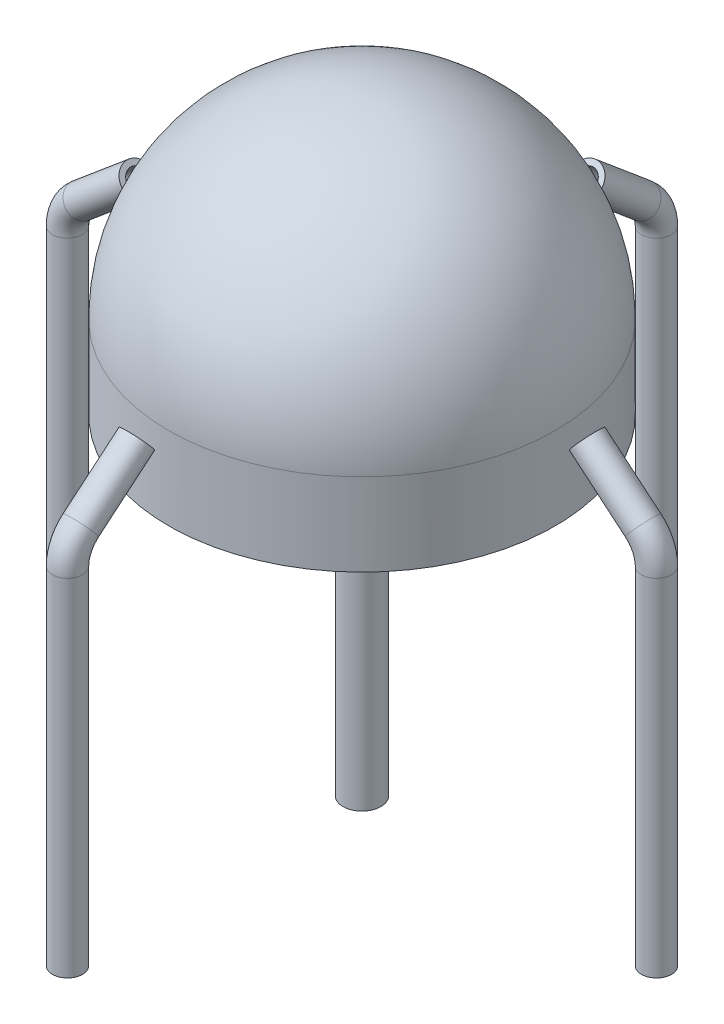
ISO-10303-21;
HEADER;
FILE_DESCRIPTION(('STEP AP214'),'2;1');
FILE_NAME('part.step','',(''),(''),'','','');
FILE_SCHEMA(('AUTOMOTIVE_DESIGN { 1 0 10303 214 1 1 1 1 }'));
ENDSEC;
DATA;
#1=APPLICATION_CONTEXT('core data for automotive mechanical design processes');
#2=APPLICATION_PROTOCOL_DEFINITION('international standard','automotive_design',2000,#1);
#3=PRODUCT_CONTEXT('',#1,'mechanical');
#4=PRODUCT('Part','Part','',(#3));
#5=PRODUCT_RELATED_PRODUCT_CATEGORY('part','',(#4));
#6=PRODUCT_DEFINITION_FORMATION('','',#4);
#7=PRODUCT_DEFINITION_CONTEXT('part definition',#1,'design');
#8=PRODUCT_DEFINITION('design','',#6,#7);
#9=PRODUCT_DEFINITION_SHAPE('','',#8);
#10=(LENGTH_UNIT() NAMED_UNIT(*) SI_UNIT(.MILLI.,.METRE.));
#11=(NAMED_UNIT(*) PLANE_ANGLE_UNIT() SI_UNIT($,.RADIAN.));
#12=(NAMED_UNIT(*) SI_UNIT($,.STERADIAN.) SOLID_ANGLE_UNIT());
#13=UNCERTAINTY_MEASURE_WITH_UNIT(LENGTH_MEASURE(1.E-05),#10,'distance_accuracy_value','');
#14=(GEOMETRIC_REPRESENTATION_CONTEXT(3) GLOBAL_UNCERTAINTY_ASSIGNED_CONTEXT((#13)) GLOBAL_UNIT_ASSIGNED_CONTEXT((#10,
#11,#12)) REPRESENTATION_CONTEXT('',''));
#15=CARTESIAN_POINT('',(0.,0.,0.));
#16=DIRECTION('',(0.,0.,1.));
#17=DIRECTION('',(1.,0.,0.));
#18=AXIS2_PLACEMENT_3D('',#15,#16,#17);
#19=CARTESIAN_POINT('',(0.,0.,0.));
#20=DIRECTION('',(0.,1.,0.));
#21=DIRECTION('',(0.,0.,1.));
#22=AXIS2_PLACEMENT_3D('',#19,#20,#21);
#23=PLANE('',#22);
#24=CARTESIAN_POINT('',(0.,0.,0.));
#25=DIRECTION('',(0.,1.,0.));
#26=DIRECTION('',(0.,0.,1.));
#27=AXIS2_PLACEMENT_3D('',#24,#25,#26);
#28=CIRCLE('',#27,3.54);
#29=CARTESIAN_POINT('',(0.,0.,3.54));
#30=VERTEX_POINT('',#29);
#31=EDGE_CURVE('E57',#30,#30,#28,.T.);
#32=ORIENTED_EDGE('',*,*,#31,.F.);
#33=EDGE_LOOP('',(#32));
#34=FACE_BOUND('',#33,.T.);
#35=CARTESIAN_POINT('',(0.,0.,0.));
#36=DIRECTION('',(0.,1.,0.));
#37=DIRECTION('',(0.,0.,1.));
#38=AXIS2_PLACEMENT_3D('',#35,#36,#37);
#39=CIRCLE('',#38,5.04);
#40=CARTESIAN_POINT('',(0.,0.,5.04));
#41=VERTEX_POINT('',#40);
#42=EDGE_CURVE('E46',#41,#41,#39,.T.);
#43=ORIENTED_EDGE('',*,*,#42,.T.);
#44=EDGE_LOOP('',(#43));
#45=FACE_BOUND('',#44,.T.);
#46=ADVANCED_FACE('F42',(#34,#45),#23,.T.);
#47=CARTESIAN_POINT('',(0.,-110.,0.));
#48=DIRECTION('',(0.,1.,0.));
#49=DIRECTION('',(0.,0.,1.));
#50=AXIS2_PLACEMENT_3D('',#47,#48,#49);
#51=PLANE('',#50);
#52=CARTESIAN_POINT('',(0.,-110.,0.));
#53=DIRECTION('',(0.,1.,0.));
#54=DIRECTION('',(0.,0.,1.));
#55=AXIS2_PLACEMENT_3D('',#52,#53,#54);
#56=CIRCLE('',#55,3.54);
#57=CARTESIAN_POINT('',(0.,-110.,3.54));
#58=VERTEX_POINT('',#57);
#59=EDGE_CURVE('E53',#58,#58,#56,.T.);
#60=ORIENTED_EDGE('',*,*,#59,.T.);
#61=EDGE_LOOP('',(#60));
#62=FACE_BOUND('',#61,.T.);
#63=CARTESIAN_POINT('',(0.,-110.,0.));
#64=DIRECTION('',(0.,1.,0.));
#65=DIRECTION('',(0.,0.,1.));
#66=AXIS2_PLACEMENT_3D('',#63,#64,#65);
#67=CIRCLE('',#66,5.04);
#68=CARTESIAN_POINT('',(0.,-110.,5.04));
#69=VERTEX_POINT('',#68);
#70=EDGE_CURVE('E11',#69,#69,#67,.T.);
#71=ORIENTED_EDGE('',*,*,#70,.F.);
#72=EDGE_LOOP('',(#71));
#73=FACE_BOUND('',#72,.T.);
#74=ADVANCED_FACE('F65',(#62,#73),#51,.F.);
#75=CARTESIAN_POINT('',(0.,0.,0.));
#76=DIRECTION('',(0.,-1.,0.));
#77=DIRECTION('',(0.,0.,-1.));
#78=AXIS2_PLACEMENT_3D('',#75,#76,#77);
#79=CYLINDRICAL_SURFACE('',#78,5.04);
#80=ORIENTED_EDGE('',*,*,#70,.T.);
#81=EDGE_LOOP('',(#80));
#82=FACE_BOUND('',#81,.T.);
#83=ORIENTED_EDGE('',*,*,#42,.F.);
#84=EDGE_LOOP('',(#83));
#85=FACE_BOUND('',#84,.T.);
#86=ADVANCED_FACE('F44',(#82,#85),#79,.T.);
#87=CARTESIAN_POINT('',(0.,0.,0.));
#88=DIRECTION('',(0.,-1.,0.));
#89=DIRECTION('',(0.,0.,-1.));
#90=AXIS2_PLACEMENT_3D('',#87,#88,#89);
#91=CYLINDRICAL_SURFACE('',#90,3.54);
#92=ORIENTED_EDGE('',*,*,#59,.F.);
#93=EDGE_LOOP('',(#92));
#94=FACE_BOUND('',#93,.T.);
#95=ORIENTED_EDGE('',*,*,#31,.T.);
#96=EDGE_LOOP('',(#95));
#97=FACE_BOUND('',#96,.T.);
#98=ADVANCED_FACE('F61',(#94,#97),#91,.F.);
#99=CLOSED_SHELL('',(#46,#74,#86,#98));
#100=MANIFOLD_SOLID_BREP('B2',#99);
#101=CARTESIAN_POINT('',(0.,-110.,-78.4800007493152));
#102=DIRECTION('',(0.,1.,0.));
#103=DIRECTION('',(0.,0.,1.));
#104=AXIS2_PLACEMENT_3D('',#101,#102,#103);
#105=PLANE('',#104);
#106=CARTESIAN_POINT('',(0.,-110.,-78.4800007493152));
#107=DIRECTION('',(0.,1.,0.));
#108=DIRECTION('',(0.,0.,1.));
#109=AXIS2_PLACEMENT_3D('',#106,#107,#108);
#110=CIRCLE('',#109,2.5);
#111=CARTESIAN_POINT('',(0.,-110.,-75.9800007493152));
#112=VERTEX_POINT('',#111);
#113=EDGE_CURVE('E141',#112,#112,#110,.T.);
#114=ORIENTED_EDGE('',*,*,#113,.T.);
#115=EDGE_LOOP('',(#114));
#116=FACE_BOUND('',#115,.T.);
#117=CARTESIAN_POINT('',(0.,-110.,-78.4800007493152));
#118=DIRECTION('',(0.,1.,0.));
#119=DIRECTION('',(0.,0.,1.));
#120=AXIS2_PLACEMENT_3D('',#117,#118,#119);
#121=CIRCLE('',#120,4.);
#122=CARTESIAN_POINT('',(0.,-110.,-74.4800007493152));
#123=VERTEX_POINT('',#122);
#124=EDGE_CURVE('E124',#123,#123,#121,.T.);
#125=ORIENTED_EDGE('',*,*,#124,.F.);
#126=EDGE_LOOP('',(#125));
#127=FACE_BOUND('',#126,.T.);
#128=ADVANCED_FACE('F112',(#116,#127),#105,.F.);
#129=CARTESIAN_POINT('',(0.,2.39999999999995,-60.));
#130=DIRECTION('',(0.,0.642758197121759,0.76606912222905));
#131=DIRECTION('',(0.,-0.76606912222905,0.642758197121759));
#132=AXIS2_PLACEMENT_3D('',#129,#130,#131);
#133=PLANE('',#132);
#134=CARTESIAN_POINT('',(0.,2.39999999999995,-60.));
#135=DIRECTION('',(0.,0.642758197121759,0.76606912222905));
#136=DIRECTION('',(0.,-0.76606912222905,0.642758197121759));
#137=AXIS2_PLACEMENT_3D('',#134,#135,#136);
#138=CIRCLE('',#137,2.5);
#139=CARTESIAN_POINT('',(0.,0.484827194427324,-58.3931045071956));
#140=VERTEX_POINT('',#139);
#141=EDGE_CURVE('E136',#140,#140,#138,.T.);
#142=ORIENTED_EDGE('',*,*,#141,.F.);
#143=EDGE_LOOP('',(#142));
#144=FACE_BOUND('',#143,.T.);
#145=CARTESIAN_POINT('',(0.,2.39999999999995,-60.));
#146=DIRECTION('',(0.,0.642758197121759,0.76606912222905));
#147=DIRECTION('',(0.,-0.76606912222905,0.642758197121759));
#148=AXIS2_PLACEMENT_3D('',#145,#146,#147);
#149=CIRCLE('',#148,4.);
#150=CARTESIAN_POINT('',(0.,-0.66427648891625,-57.428967211513));
#151=VERTEX_POINT('',#150);
#152=EDGE_CURVE('E116',#151,#151,#149,.T.);
#153=ORIENTED_EDGE('',*,*,#152,.T.);
#154=EDGE_LOOP('',(#153));
#155=FACE_BOUND('',#154,.T.);
#156=ADVANCED_FACE('F174',(#144,#155),#133,.T.);
#157=CARTESIAN_POINT('',(0.,-17.7661298370008,-68.4854328987603));
#158=DIRECTION('',(-1.,0.,0.));
#159=DIRECTION('',(0.,0.,1.));
#160=AXIS2_PLACEMENT_3D('',#157,#158,#159);
#161=TOROIDAL_SURFACE('',#160,9.9945678505549,4.);
#162=CARTESIAN_POINT('',(0.,-10.1096000315074,-74.9095232989428));
#163=DIRECTION('',(0.,-0.642758197121758,-0.76606912222905));
#164=DIRECTION('',(0.,0.76606912222905,-0.642758197121758));
#165=AXIS2_PLACEMENT_3D('',#162,#163,#164);
#166=CIRCLE('',#165,4.);
#167=CARTESIAN_POINT('',(0.,-7.04532352775131,-77.4805560998811));
#168=VERTEX_POINT('',#167);
#169=EDGE_CURVE('E41',#168,#168,#166,.F.);
#170=CARTESIAN_POINT('',(0.,-17.7661298370008,-78.4800007493152));
#171=DIRECTION('',(0.,1.,0.));
#172=DIRECTION('',(0.,0.,1.));
#173=AXIS2_PLACEMENT_3D('',#170,#171,#172);
#174=CIRCLE('',#173,4.);
#175=CARTESIAN_POINT('',(0.,-17.7661298370008,-82.4800007493152));
#176=VERTEX_POINT('',#175);
#177=EDGE_CURVE('E126',#176,#176,#174,.T.);
#178=CARTESIAN_POINT('',(0.,-17.7661298370008,-68.4854328987603));
#179=DIRECTION('',(-1.,0.,0.));
#180=DIRECTION('',(0.,0.,1.));
#181=AXIS2_PLACEMENT_3D('',#178,#179,#180);
#182=CIRCLE('',#181,13.9945678505549);
#183=EDGE_CURVE('',#168,#176,#182,.T.);
#184=ORIENTED_EDGE('',*,*,#169,.F.);
#185=ORIENTED_EDGE('',*,*,#177,.T.);
#186=ORIENTED_EDGE('',*,*,#183,.T.);
#187=ORIENTED_EDGE('',*,*,#183,.F.);
#188=EDGE_LOOP('',(#184,#186,#185,#187));
#189=FACE_BOUND('',#188,.T.);
#190=ADVANCED_FACE('F177',(#189),#161,.T.);
#191=CARTESIAN_POINT('',(0.,-17.7661298370008,-78.4800007493152));
#192=DIRECTION('',(0.,-1.,0.));
#193=DIRECTION('',(0.,0.,-1.));
#194=AXIS2_PLACEMENT_3D('',#191,#192,#193);
#195=CYLINDRICAL_SURFACE('',#194,4.);
#196=ORIENTED_EDGE('',*,*,#124,.T.);
#197=EDGE_LOOP('',(#196));
#198=FACE_BOUND('',#197,.T.);
#199=ORIENTED_EDGE('',*,*,#177,.F.);
#200=EDGE_LOOP('',(#199));
#201=FACE_BOUND('',#200,.T.);
#202=ADVANCED_FACE('F183',(#198,#201),#195,.T.);
#203=CARTESIAN_POINT('',(0.,2.39999999999995,-60.));
#204=DIRECTION('',(0.,-0.642758197121758,-0.76606912222905));
#205=DIRECTION('',(0.,0.76606912222905,-0.642758197121758));
#206=AXIS2_PLACEMENT_3D('',#203,#204,#205);
#207=CYLINDRICAL_SURFACE('',#206,4.);
#208=ORIENTED_EDGE('',*,*,#169,.T.);
#209=EDGE_LOOP('',(#208));
#210=FACE_BOUND('',#209,.T.);
#211=ORIENTED_EDGE('',*,*,#152,.F.);
#212=EDGE_LOOP('',(#211));
#213=FACE_BOUND('',#212,.T.);
#214=ADVANCED_FACE('F114',(#210,#213),#207,.T.);
#215=CARTESIAN_POINT('',(0.,-17.7661298370008,-68.4854328987603));
#216=DIRECTION('',(-1.,0.,0.));
#217=DIRECTION('',(0.,0.,1.));
#218=AXIS2_PLACEMENT_3D('',#215,#216,#217);
#219=TOROIDAL_SURFACE('',#218,9.9945678505549,2.5);
#220=CARTESIAN_POINT('',(0.,-17.7661298370008,-78.4800007493151));
#221=DIRECTION('',(0.,1.,0.));
#222=DIRECTION('',(0.,0.,1.));
#223=AXIS2_PLACEMENT_3D('',#220,#221,#222);
#224=CIRCLE('',#223,2.5);
#225=CARTESIAN_POINT('',(0.,-17.7661298370008,-75.9800007493151));
#226=VERTEX_POINT('',#225);
#227=EDGE_CURVE('E242',#226,#226,#224,.T.);
#228=ORIENTED_EDGE('',*,*,#227,.F.);
#229=EDGE_LOOP('',(#228));
#230=FACE_BOUND('',#229,.T.);
#231=CARTESIAN_POINT('',(0.,-10.11,-74.91));
#232=DIRECTION('',(0.,0.642758197121759,0.76606912222905));
#233=DIRECTION('',(0.,-0.76606912222905,0.642758197121759));
#234=AXIS2_PLACEMENT_3D('',#231,#232,#233);
#235=CIRCLE('',#234,2.5);
#236=CARTESIAN_POINT('',(0.,-12.0251728055727,-73.3031045071956));
#237=VERTEX_POINT('',#236);
#238=EDGE_CURVE('E132',#237,#237,#235,.T.);
#239=ORIENTED_EDGE('',*,*,#238,.T.);
#240=EDGE_LOOP('',(#239));
#241=FACE_BOUND('',#240,.T.);
#242=ADVANCED_FACE('F166',(#230,#241),#219,.F.);
#243=CARTESIAN_POINT('',(0.,-17.7661298370008,-78.4800007493152));
#244=DIRECTION('',(0.,-1.,0.));
#245=DIRECTION('',(0.,0.,-1.));
#246=AXIS2_PLACEMENT_3D('',#243,#244,#245);
#247=CYLINDRICAL_SURFACE('',#246,2.5);
#248=ORIENTED_EDGE('',*,*,#113,.F.);
#249=EDGE_LOOP('',(#248));
#250=FACE_BOUND('',#249,.T.);
#251=ORIENTED_EDGE('',*,*,#227,.T.);
#252=EDGE_LOOP('',(#251));
#253=FACE_BOUND('',#252,.T.);
#254=ADVANCED_FACE('F165',(#250,#253),#247,.F.);
#255=CARTESIAN_POINT('',(0.,2.39999999999995,-60.));
#256=DIRECTION('',(0.,-0.642758197121758,-0.76606912222905));
#257=DIRECTION('',(0.,0.76606912222905,-0.642758197121758));
#258=AXIS2_PLACEMENT_3D('',#255,#256,#257);
#259=CYLINDRICAL_SURFACE('',#258,2.5);
#260=ORIENTED_EDGE('',*,*,#238,.F.);
#261=EDGE_LOOP('',(#260));
#262=FACE_BOUND('',#261,.T.);
#263=ORIENTED_EDGE('',*,*,#141,.T.);
#264=EDGE_LOOP('',(#263));
#265=FACE_BOUND('',#264,.T.);
#266=ADVANCED_FACE('F157',(#262,#265),#259,.F.);
#267=CLOSED_SHELL('',(#128,#156,#190,#202,#214,#242,#254,#266));
#268=MANIFOLD_SOLID_BREP('B6',#267);
#269=CARTESIAN_POINT('',(-78.4800007493152,-110.,0.));
#270=DIRECTION('',(0.,1.,0.));
#271=DIRECTION('',(0.,0.,1.));
#272=AXIS2_PLACEMENT_3D('',#269,#270,#271);
#273=PLANE('',#272);
#274=CARTESIAN_POINT('',(-78.4800007493152,-110.,0.));
#275=DIRECTION('',(0.,1.,0.));
#276=DIRECTION('',(0.,0.,1.));
#277=AXIS2_PLACEMENT_3D('',#274,#275,#276);
#278=CIRCLE('',#277,2.5);
#279=CARTESIAN_POINT('',(-78.4800007493152,-110.,2.49999999999999));
#280=VERTEX_POINT('',#279);
#281=EDGE_CURVE('E327',#280,#280,#278,.T.);
#282=ORIENTED_EDGE('',*,*,#281,.T.);
#283=EDGE_LOOP('',(#282));
#284=FACE_BOUND('',#283,.T.);
#285=CARTESIAN_POINT('',(-78.4800007493152,-110.,0.));
#286=DIRECTION('',(0.,1.,0.));
#287=DIRECTION('',(0.,0.,1.));
#288=AXIS2_PLACEMENT_3D('',#285,#286,#287);
#289=CIRCLE('',#288,3.99999999999999);
#290=CARTESIAN_POINT('',(-78.4800007493152,-110.,3.99999999999999));
#291=VERTEX_POINT('',#290);
#292=EDGE_CURVE('E276',#291,#291,#289,.T.);
#293=ORIENTED_EDGE('',*,*,#292,.F.);
#294=EDGE_LOOP('',(#293));
#295=FACE_BOUND('',#294,.T.);
#296=ADVANCED_FACE('F264',(#284,#295),#273,.F.);
#297=CARTESIAN_POINT('',(-60.,2.39999999999998,0.));
#298=DIRECTION('',(0.76606912222905,0.642758197121758,0.));
#299=DIRECTION('',(0.,0.,1.));
#300=AXIS2_PLACEMENT_3D('',#297,#298,#299);
#301=PLANE('',#300);
#302=CARTESIAN_POINT('',(-60.,2.39999999999998,0.));
#303=DIRECTION('',(0.76606912222905,0.642758197121758,0.));
#304=DIRECTION('',(0.,0.,1.));
#305=AXIS2_PLACEMENT_3D('',#302,#303,#304);
#306=CIRCLE('',#305,2.5);
#307=CARTESIAN_POINT('',(-60.,2.39999999999998,2.50000000000001));
#308=VERTEX_POINT('',#307);
#309=EDGE_CURVE('E319',#308,#308,#306,.T.);
#310=ORIENTED_EDGE('',*,*,#309,.F.);
#311=EDGE_LOOP('',(#310));
#312=FACE_BOUND('',#311,.T.);
#313=CARTESIAN_POINT('',(-60.,2.39999999999998,0.));
#314=DIRECTION('',(0.76606912222905,0.642758197121758,0.));
#315=DIRECTION('',(-0.642758197121758,0.76606912222905,0.));
#316=AXIS2_PLACEMENT_3D('',#313,#314,#315);
#317=CIRCLE('',#316,3.99999999999999);
#318=CARTESIAN_POINT('',(-62.571032788487,5.46427648891618,0.));
#319=VERTEX_POINT('',#318);
#320=EDGE_CURVE('E268',#319,#319,#317,.T.);
#321=ORIENTED_EDGE('',*,*,#320,.T.);
#322=EDGE_LOOP('',(#321));
#323=FACE_BOUND('',#322,.T.);
#324=ADVANCED_FACE('F300',(#312,#323),#301,.T.);
#325=CARTESIAN_POINT('',(-68.4854328987603,-17.7661298370008,0.));
#326=DIRECTION('',(0.,0.,1.));
#327=DIRECTION('',(1.,0.,0.));
#328=AXIS2_PLACEMENT_3D('',#325,#326,#327);
#329=TOROIDAL_SURFACE('',#328,9.99456785055491,3.99999999999999);
#330=CARTESIAN_POINT('',(-78.4800007493152,-17.7661298370008,0.));
#331=DIRECTION('',(0.,1.,0.));
#332=DIRECTION('',(-1.,0.,0.));
#333=AXIS2_PLACEMENT_3D('',#330,#331,#332);
#334=CIRCLE('',#333,3.99999999999999);
#335=CARTESIAN_POINT('',(-82.4800007493152,-17.7661298370008,0.));
#336=VERTEX_POINT('',#335);
#337=EDGE_CURVE('E280',#336,#336,#334,.T.);
#338=ORIENTED_EDGE('',*,*,#337,.T.);
#339=EDGE_LOOP('',(#338));
#340=FACE_BOUND('',#339,.T.);
#341=CARTESIAN_POINT('',(-74.91,-10.11,0.));
#342=DIRECTION('',(0.76606912222905,0.642758197121758,0.));
#343=DIRECTION('',(0.,0.,1.));
#344=AXIS2_PLACEMENT_3D('',#341,#342,#343);
#345=CIRCLE('',#344,3.99999999999999);
#346=CARTESIAN_POINT('',(-74.91,-10.11,3.99999999999999));
#347=VERTEX_POINT('',#346);
#348=EDGE_CURVE('E111',#347,#347,#345,.T.);
#349=ORIENTED_EDGE('',*,*,#348,.F.);
#350=EDGE_LOOP('',(#349));
#351=FACE_BOUND('',#350,.T.);
#352=ADVANCED_FACE('F291',(#340,#351),#329,.T.);
#353=CARTESIAN_POINT('',(-78.4800007493152,-17.7661298370008,0.));
#354=DIRECTION('',(0.,-1.,0.));
#355=DIRECTION('',(0.,0.,-1.));
#356=AXIS2_PLACEMENT_3D('',#353,#354,#355);
#357=CYLINDRICAL_SURFACE('',#356,3.99999999999999);
#358=ORIENTED_EDGE('',*,*,#292,.T.);
#359=EDGE_LOOP('',(#358));
#360=FACE_BOUND('',#359,.T.);
#361=ORIENTED_EDGE('',*,*,#337,.F.);
#362=EDGE_LOOP('',(#361));
#363=FACE_BOUND('',#362,.T.);
#364=ADVANCED_FACE('F266',(#360,#363),#357,.T.);
#365=CARTESIAN_POINT('',(-60.,2.39999999999998,0.));
#366=DIRECTION('',(-0.76606912222905,-0.642758197121758,0.));
#367=DIRECTION('',(0.642758197121758,-0.76606912222905,0.));
#368=AXIS2_PLACEMENT_3D('',#365,#366,#367);
#369=CYLINDRICAL_SURFACE('',#368,3.99999999999999);
#370=ORIENTED_EDGE('',*,*,#348,.T.);
#371=EDGE_LOOP('',(#370));
#372=FACE_BOUND('',#371,.T.);
#373=ORIENTED_EDGE('',*,*,#320,.F.);
#374=EDGE_LOOP('',(#373));
#375=FACE_BOUND('',#374,.T.);
#376=ADVANCED_FACE('F302',(#372,#375),#369,.T.);
#377=CARTESIAN_POINT('',(-68.4854328987603,-17.7661298370008,0.));
#378=DIRECTION('',(0.,0.,1.));
#379=DIRECTION('',(1.,0.,0.));
#380=AXIS2_PLACEMENT_3D('',#377,#378,#379);
#381=TOROIDAL_SURFACE('',#380,9.99456785055491,2.5);
#382=CARTESIAN_POINT('',(-78.4800007493152,-17.7661298370008,0.));
#383=DIRECTION('',(0.,1.,0.));
#384=DIRECTION('',(0.,0.,1.));
#385=AXIS2_PLACEMENT_3D('',#382,#383,#384);
#386=CIRCLE('',#385,2.5);
#387=CARTESIAN_POINT('',(-78.4800007493152,-17.7661298370008,2.49999999999998));
#388=VERTEX_POINT('',#387);
#389=EDGE_CURVE('E361',#388,#388,#386,.T.);
#390=ORIENTED_EDGE('',*,*,#389,.F.);
#391=EDGE_LOOP('',(#390));
#392=FACE_BOUND('',#391,.T.);
#393=CARTESIAN_POINT('',(-74.91,-10.11,0.));
#394=DIRECTION('',(0.76606912222905,0.642758197121758,0.));
#395=DIRECTION('',(0.,0.,1.));
#396=AXIS2_PLACEMENT_3D('',#393,#394,#395);
#397=CIRCLE('',#396,2.5);
#398=CARTESIAN_POINT('',(-74.91,-10.11,2.49999999999999));
#399=VERTEX_POINT('',#398);
#400=EDGE_CURVE('E284',#399,#399,#397,.T.);
#401=ORIENTED_EDGE('',*,*,#400,.T.);
#402=EDGE_LOOP('',(#401));
#403=FACE_BOUND('',#402,.T.);
#404=ADVANCED_FACE('F306',(#392,#403),#381,.F.);
#405=CARTESIAN_POINT('',(-78.4800007493152,-17.7661298370008,0.));
#406=DIRECTION('',(0.,-1.,0.));
#407=DIRECTION('',(0.,0.,-1.));
#408=AXIS2_PLACEMENT_3D('',#405,#406,#407);
#409=CYLINDRICAL_SURFACE('',#408,2.5);
#410=ORIENTED_EDGE('',*,*,#281,.F.);
#411=EDGE_LOOP('',(#410));
#412=FACE_BOUND('',#411,.T.);
#413=ORIENTED_EDGE('',*,*,#389,.T.);
#414=EDGE_LOOP('',(#413));
#415=FACE_BOUND('',#414,.T.);
#416=ADVANCED_FACE('F343',(#412,#415),#409,.F.);
#417=CARTESIAN_POINT('',(-60.,2.39999999999998,0.));
#418=DIRECTION('',(-0.76606912222905,-0.642758197121758,0.));
#419=DIRECTION('',(0.642758197121758,-0.76606912222905,0.));
#420=AXIS2_PLACEMENT_3D('',#417,#418,#419);
#421=CYLINDRICAL_SURFACE('',#420,2.5);
#422=ORIENTED_EDGE('',*,*,#400,.F.);
#423=EDGE_LOOP('',(#422));
#424=FACE_BOUND('',#423,.T.);
#425=ORIENTED_EDGE('',*,*,#309,.T.);
#426=EDGE_LOOP('',(#425));
#427=FACE_BOUND('',#426,.T.);
#428=ADVANCED_FACE('F335',(#424,#427),#421,.F.);
#429=CLOSED_SHELL('',(#296,#324,#352,#364,#376,#404,#416,#428));
#430=MANIFOLD_SOLID_BREP('B36',#429);
#431=CARTESIAN_POINT('',(-1.45716771982052E-13,-110.,78.480000749315));
#432=DIRECTION('',(0.,1.,0.));
#433=DIRECTION('',(0.,0.,1.));
#434=AXIS2_PLACEMENT_3D('',#431,#432,#433);
#435=PLANE('',#434);
#436=CARTESIAN_POINT('',(-1.45716771982052E-13,-110.,78.480000749315));
#437=DIRECTION('',(0.,1.,0.));
#438=DIRECTION('',(0.,0.,1.));
#439=AXIS2_PLACEMENT_3D('',#436,#437,#438);
#440=CIRCLE('',#439,2.5);
#441=CARTESIAN_POINT('',(2.49999999999986,-110.,78.480000749315));
#442=VERTEX_POINT('',#441);
#443=EDGE_CURVE('E464',#442,#442,#440,.T.);
#444=ORIENTED_EDGE('',*,*,#443,.T.);
#445=EDGE_LOOP('',(#444));
#446=FACE_BOUND('',#445,.T.);
#447=CARTESIAN_POINT('',(-1.45716771982052E-13,-110.,78.480000749315));
#448=DIRECTION('',(0.,1.,0.));
#449=DIRECTION('',(0.,0.,1.));
#450=AXIS2_PLACEMENT_3D('',#447,#448,#449);
#451=CIRCLE('',#450,4.);
#452=CARTESIAN_POINT('',(-1.45716771982052E-13,-110.,82.480000749315));
#453=VERTEX_POINT('',#452);
#454=EDGE_CURVE('E447',#453,#453,#451,.T.);
#455=ORIENTED_EDGE('',*,*,#454,.F.);
#456=EDGE_LOOP('',(#455));
#457=FACE_BOUND('',#456,.T.);
#458=ADVANCED_FACE('F435',(#446,#457),#435,.F.);
#459=CARTESIAN_POINT('',(0.,2.39999999999998,60.));
#460=DIRECTION('',(0.,0.642758197121758,-0.76606912222905));
#461=DIRECTION('',(0.,0.76606912222905,0.642758197121758));
#462=AXIS2_PLACEMENT_3D('',#459,#460,#461);
#463=PLANE('',#462);
#464=CARTESIAN_POINT('',(0.,2.39999999999998,60.));
#465=DIRECTION('',(0.,0.642758197121758,-0.76606912222905));
#466=DIRECTION('',(0.,0.76606912222905,0.642758197121758));
#467=AXIS2_PLACEMENT_3D('',#464,#465,#466);
#468=CIRCLE('',#467,2.5);
#469=CARTESIAN_POINT('',(0.,4.3151728055726,61.6068954928044));
#470=VERTEX_POINT('',#469);
#471=EDGE_CURVE('E459',#470,#470,#468,.T.);
#472=ORIENTED_EDGE('',*,*,#471,.F.);
#473=EDGE_LOOP('',(#472));
#474=FACE_BOUND('',#473,.T.);
#475=CARTESIAN_POINT('',(0.,2.39999999999998,60.));
#476=DIRECTION('',(0.,0.642758197121758,-0.76606912222905));
#477=DIRECTION('',(0.,0.76606912222905,0.642758197121758));
#478=AXIS2_PLACEMENT_3D('',#475,#476,#477);
#479=CIRCLE('',#478,4.);
#480=CARTESIAN_POINT('',(0.,5.46427648891618,62.5710327884871));
#481=VERTEX_POINT('',#480);
#482=EDGE_CURVE('E439',#481,#481,#479,.T.);
#483=ORIENTED_EDGE('',*,*,#482,.T.);
#484=EDGE_LOOP('',(#483));
#485=FACE_BOUND('',#484,.T.);
#486=ADVANCED_FACE('F497',(#474,#485),#463,.T.);
#487=CARTESIAN_POINT('',(0.,-17.7661298370008,68.4854328987603));
#488=DIRECTION('',(1.,0.,0.));
#489=DIRECTION('',(0.,1.,0.));
#490=AXIS2_PLACEMENT_3D('',#487,#488,#489);
#491=TOROIDAL_SURFACE('',#490,9.99456785055488,4.);
#492=CARTESIAN_POINT('',(0.,-10.1096000315074,74.9095232989428));
#493=DIRECTION('',(0.,-0.642758197121759,0.76606912222905));
#494=DIRECTION('',(0.,-0.76606912222905,-0.642758197121759));
#495=AXIS2_PLACEMENT_3D('',#492,#493,#494);
#496=CIRCLE('',#495,4.);
#497=CARTESIAN_POINT('',(0.,-7.0453235277513,77.480556099881));
#498=VERTEX_POINT('',#497);
#499=EDGE_CURVE('E263',#498,#498,#496,.F.);
#500=CARTESIAN_POINT('',(0.,-17.766129837001,78.4800007493152));
#501=DIRECTION('',(0.,1.,0.));
#502=DIRECTION('',(0.,0.,1.));
#503=AXIS2_PLACEMENT_3D('',#500,#501,#502);
#504=CIRCLE('',#503,4.);
#505=CARTESIAN_POINT('',(0.,-17.7661298370011,82.4800007493152));
#506=VERTEX_POINT('',#505);
#507=EDGE_CURVE('E449',#506,#506,#504,.T.);
#508=CARTESIAN_POINT('',(0.,-17.7661298370008,68.4854328987603));
#509=DIRECTION('',(1.,0.,0.));
#510=DIRECTION('',(0.,1.,0.));
#511=AXIS2_PLACEMENT_3D('',#508,#509,#510);
#512=CIRCLE('',#511,13.9945678505549);
#513=EDGE_CURVE('',#498,#506,#512,.T.);
#514=ORIENTED_EDGE('',*,*,#499,.F.);
#515=ORIENTED_EDGE('',*,*,#507,.T.);
#516=ORIENTED_EDGE('',*,*,#513,.T.);
#517=ORIENTED_EDGE('',*,*,#513,.F.);
#518=EDGE_LOOP('',(#514,#516,#515,#517));
#519=FACE_BOUND('',#518,.T.);
#520=ADVANCED_FACE('F500',(#519),#491,.T.);
#521=CARTESIAN_POINT('',(0.,-17.7661298370008,78.4800007493152));
#522=DIRECTION('',(0.,-1.,0.));
#523=DIRECTION('',(1.,0.,0.));
#524=AXIS2_PLACEMENT_3D('',#521,#522,#523);
#525=CYLINDRICAL_SURFACE('',#524,4.);
#526=ORIENTED_EDGE('',*,*,#454,.T.);
#527=EDGE_LOOP('',(#526));
#528=FACE_BOUND('',#527,.T.);
#529=ORIENTED_EDGE('',*,*,#507,.F.);
#530=EDGE_LOOP('',(#529));
#531=FACE_BOUND('',#530,.T.);
#532=ADVANCED_FACE('F506',(#528,#531),#525,.T.);
#533=CARTESIAN_POINT('',(0.,2.39999999999998,60.));
#534=DIRECTION('',(0.,-0.642758197121759,0.76606912222905));
#535=DIRECTION('',(0.,-0.76606912222905,-0.642758197121759));
#536=AXIS2_PLACEMENT_3D('',#533,#534,#535);
#537=CYLINDRICAL_SURFACE('',#536,4.);
#538=ORIENTED_EDGE('',*,*,#499,.T.);
#539=EDGE_LOOP('',(#538));
#540=FACE_BOUND('',#539,.T.);
#541=ORIENTED_EDGE('',*,*,#482,.F.);
#542=EDGE_LOOP('',(#541));
#543=FACE_BOUND('',#542,.T.);
#544=ADVANCED_FACE('F437',(#540,#543),#537,.T.);
#545=CARTESIAN_POINT('',(0.,-17.7661298370008,68.4854328987603));
#546=DIRECTION('',(1.,0.,0.));
#547=DIRECTION('',(0.,1.,0.));
#548=AXIS2_PLACEMENT_3D('',#545,#546,#547);
#549=TOROIDAL_SURFACE('',#548,9.99456785055488,2.5);
#550=CARTESIAN_POINT('',(0.,-17.7661298370009,78.480000749315));
#551=DIRECTION('',(0.,1.,0.));
#552=DIRECTION('',(0.,0.,1.));
#553=AXIS2_PLACEMENT_3D('',#550,#551,#552);
#554=CIRCLE('',#553,2.5);
#555=CARTESIAN_POINT('',(2.49999999999999,-17.7661298370009,78.4800007493152));
#556=VERTEX_POINT('',#555);
#557=EDGE_CURVE('E565',#556,#556,#554,.T.);
#558=ORIENTED_EDGE('',*,*,#557,.F.);
#559=EDGE_LOOP('',(#558));
#560=FACE_BOUND('',#559,.T.);
#561=CARTESIAN_POINT('',(0.,-10.11,74.91));
#562=DIRECTION('',(0.,0.642758197121758,-0.76606912222905));
#563=DIRECTION('',(0.,0.76606912222905,0.642758197121758));
#564=AXIS2_PLACEMENT_3D('',#561,#562,#563);
#565=CIRCLE('',#564,2.5);
#566=CARTESIAN_POINT('',(0.,-8.1948271944274,76.5168954928044));
#567=VERTEX_POINT('',#566);
#568=EDGE_CURVE('E455',#567,#567,#565,.T.);
#569=ORIENTED_EDGE('',*,*,#568,.T.);
#570=EDGE_LOOP('',(#569));
#571=FACE_BOUND('',#570,.T.);
#572=ADVANCED_FACE('F489',(#560,#571),#549,.F.);
#573=CARTESIAN_POINT('',(0.,-17.7661298370008,78.4800007493152));
#574=DIRECTION('',(0.,-1.,0.));
#575=DIRECTION('',(1.,0.,0.));
#576=AXIS2_PLACEMENT_3D('',#573,#574,#575);
#577=CYLINDRICAL_SURFACE('',#576,2.5);
#578=CARTESIAN_POINT('',(2.49999999999986,-110.,78.480000749315));
#579=CARTESIAN_POINT('',(2.49999999999986,-109.039230519135,78.480000749315));
#580=CARTESIAN_POINT('',(2.49999999999986,-108.078461038271,78.480000749315));
#581=CARTESIAN_POINT('',(2.49999999999986,-106.156922076542,78.480000749315));
#582=CARTESIAN_POINT('',(2.49999999999986,-105.196152595677,78.480000749315));
#583=CARTESIAN_POINT('',(2.49999999999987,-103.274613633948,78.480000749315));
#584=CARTESIAN_POINT('',(2.49999999999987,-102.313844153083,78.480000749315));
#585=CARTESIAN_POINT('',(2.49999999999987,-100.392305191354,78.480000749315));
#586=CARTESIAN_POINT('',(2.49999999999987,-99.4315357104897,78.480000749315));
#587=CARTESIAN_POINT('',(2.49999999999987,-97.5099967487606,78.480000749315));
#588=CARTESIAN_POINT('',(2.49999999999988,-96.549227267896,78.480000749315));
#589=CARTESIAN_POINT('',(2.49999999999988,-94.6276883061668,78.480000749315));
#590=CARTESIAN_POINT('',(2.49999999999988,-93.6669188253023,78.4800007493151));
#591=CARTESIAN_POINT('',(2.49999999999988,-91.7453798635731,78.4800007493151));
#592=CARTESIAN_POINT('',(2.49999999999988,-90.7846103827085,78.4800007493151));
#593=CARTESIAN_POINT('',(2.49999999999989,-88.8630714209794,78.4800007493151));
#594=CARTESIAN_POINT('',(2.49999999999989,-87.9023019401148,78.4800007493151));
#595=CARTESIAN_POINT('',(2.49999999999989,-85.9807629783857,78.4800007493151));
#596=CARTESIAN_POINT('',(2.49999999999989,-85.0199934975211,78.4800007493151));
#597=CARTESIAN_POINT('',(2.4999999999999,-83.0984545357919,78.4800007493151));
#598=CARTESIAN_POINT('',(2.4999999999999,-82.1376850549274,78.4800007493151));
#599=CARTESIAN_POINT('',(2.4999999999999,-80.2161460931982,78.4800007493151));
#600=CARTESIAN_POINT('',(2.4999999999999,-79.2553766123337,78.4800007493151));
#601=CARTESIAN_POINT('',(2.4999999999999,-77.3338376506045,78.4800007493151));
#602=CARTESIAN_POINT('',(2.49999999999991,-76.3730681697399,78.4800007493151));
#603=CARTESIAN_POINT('',(2.49999999999991,-74.4515292080108,78.4800007493151));
#604=CARTESIAN_POINT('',(2.49999999999991,-73.4907597271462,78.4800007493151));
#605=CARTESIAN_POINT('',(2.49999999999991,-71.5692207654171,78.4800007493151));
#606=CARTESIAN_POINT('',(2.49999999999991,-70.6084512845525,78.4800007493151));
#607=CARTESIAN_POINT('',(2.49999999999992,-68.6869123228233,78.4800007493151));
#608=CARTESIAN_POINT('',(2.49999999999992,-67.7261428419588,78.4800007493151));
#609=CARTESIAN_POINT('',(2.49999999999992,-65.8046038802296,78.4800007493151));
#610=CARTESIAN_POINT('',(2.49999999999992,-64.8438343993651,78.4800007493151));
#611=CARTESIAN_POINT('',(2.49999999999992,-62.9222954376359,78.4800007493151));
#612=CARTESIAN_POINT('',(2.49999999999993,-61.9615259567713,78.4800007493151));
#613=CARTESIAN_POINT('',(2.49999999999993,-60.0399869950422,78.4800007493151));
#614=CARTESIAN_POINT('',(2.49999999999993,-59.0792175141776,78.4800007493151));
#615=CARTESIAN_POINT('',(2.49999999999993,-57.1576785524485,78.4800007493151));
#616=CARTESIAN_POINT('',(2.49999999999994,-56.1969090715839,78.4800007493151));
#617=CARTESIAN_POINT('',(2.49999999999994,-54.2753701098547,78.4800007493151));
#618=CARTESIAN_POINT('',(2.49999999999994,-53.3146006289902,78.4800007493151));
#619=CARTESIAN_POINT('',(2.49999999999994,-51.393061667261,78.4800007493151));
#620=CARTESIAN_POINT('',(2.49999999999994,-50.4322921863964,78.4800007493151));
#621=CARTESIAN_POINT('',(2.49999999999995,-48.5107532246673,78.4800007493151));
#622=CARTESIAN_POINT('',(2.49999999999995,-47.5499837438027,78.4800007493151));
#623=CARTESIAN_POINT('',(2.49999999999995,-45.6284447820736,78.4800007493151));
#624=CARTESIAN_POINT('',(2.49999999999995,-44.667675301209,78.4800007493151));
#625=CARTESIAN_POINT('',(2.49999999999996,-42.7461363394798,78.4800007493151));
#626=CARTESIAN_POINT('',(2.49999999999996,-41.7853668586153,78.4800007493151));
#627=CARTESIAN_POINT('',(2.49999999999996,-39.8638278968861,78.4800007493151));
#628=CARTESIAN_POINT('',(2.49999999999996,-38.9030584160216,78.4800007493151));
#629=CARTESIAN_POINT('',(2.49999999999996,-36.9815194542924,78.4800007493151));
#630=CARTESIAN_POINT('',(2.49999999999996,-36.0207499734278,78.4800007493151));
#631=CARTESIAN_POINT('',(2.49999999999997,-34.0992110116987,78.4800007493151));
#632=CARTESIAN_POINT('',(2.49999999999997,-33.1384415308341,78.4800007493151));
#633=CARTESIAN_POINT('',(2.49999999999997,-31.216902569105,78.4800007493151));
#634=CARTESIAN_POINT('',(2.49999999999997,-30.2561330882404,78.4800007493151));
#635=CARTESIAN_POINT('',(2.49999999999998,-28.3345941265112,78.4800007493151));
#636=CARTESIAN_POINT('',(2.49999999999998,-27.3738246456467,78.4800007493151));
#637=CARTESIAN_POINT('',(2.49999999999998,-25.4522856839175,78.4800007493151));
#638=CARTESIAN_POINT('',(2.49999999999998,-24.4915162030529,78.4800007493151));
#639=CARTESIAN_POINT('',(2.49999999999998,-22.5699772413238,78.4800007493151));
#640=CARTESIAN_POINT('',(2.49999999999999,-21.6092077604592,78.4800007493152));
#641=CARTESIAN_POINT('',(2.49999999999999,-19.6876687987301,78.4800007493152));
#642=CARTESIAN_POINT('',(2.49999999999999,-18.7268993178655,78.4800007493152));
#643=CARTESIAN_POINT('',(2.49999999999999,-17.7661298370009,78.4800007493152));
#644=B_SPLINE_CURVE_WITH_KNOTS('',3,(#578,#579,#580,#581,#582,#583,#584,#585,#586,#587,#588,
#589,#590,#591,#592,#593,#594,#595,#596,#597,#598,#599,#600,#601,#602,#603,#604,#605,#606,#607,
#608,#609,#610,#611,#612,#613,#614,#615,#616,#617,#618,#619,#620,#621,#622,#623,#624,#625,#626,
#627,#628,#629,#630,#631,#632,#633,#634,#635,#636,#637,#638,#639,#640,#641,#642,#643),
.UNSPECIFIED.,.F.,.F.,(4,2,2,2,2,2,2,2,2,2,2,2,2,2,2,2,2,2,2,2,2,2,2,2,2,2,2,2,2,2,2,2,4),(0.,
2.88230844259373,5.76461688518745,8.64692532778116,11.5292337703749,14.4115422129686,
17.2938506555623,20.1761590981561,23.0584675407498,25.9407759833435,28.8230844259372,
31.7053928685309,34.5877013111247,37.4700097537184,40.3523181963121,43.2346266389058,
46.1169350814995,48.9992435240933,51.881551966687,54.7638604092807,57.6461688518744,
60.5284772944682,63.4107857370619,66.2930941796556,69.1754026222493,72.057711064843,
74.9400195074368,77.8223279500305,80.7046363926242,83.5869448352179,86.4692532778116,
89.3515617204054,92.2338701629991),.UNSPECIFIED.);
#645=EDGE_CURVE('BSEAM488',#442,#556,#644,.T.);
#646=ORIENTED_EDGE('',*,*,#443,.F.);
#647=ORIENTED_EDGE('',*,*,#557,.T.);
#648=ORIENTED_EDGE('',*,*,#645,.T.);
#649=ORIENTED_EDGE('',*,*,#645,.F.);
#650=EDGE_LOOP('',(#646,#648,#647,#649));
#651=FACE_BOUND('',#650,.T.);
#652=ADVANCED_FACE('F488',(#651),#577,.F.);
#653=CARTESIAN_POINT('',(0.,2.39999999999998,60.));
#654=DIRECTION('',(0.,-0.642758197121759,0.76606912222905));
#655=DIRECTION('',(0.,-0.76606912222905,-0.642758197121759));
#656=AXIS2_PLACEMENT_3D('',#653,#654,#655);
#657=CYLINDRICAL_SURFACE('',#656,2.5);
#658=ORIENTED_EDGE('',*,*,#568,.F.);
#659=EDGE_LOOP('',(#658));
#660=FACE_BOUND('',#659,.T.);
#661=ORIENTED_EDGE('',*,*,#471,.T.);
#662=EDGE_LOOP('',(#661));
#663=FACE_BOUND('',#662,.T.);
#664=ADVANCED_FACE('F480',(#660,#663),#657,.F.);
#665=CLOSED_SHELL('',(#458,#486,#520,#532,#544,#572,#652,#664));
#666=MANIFOLD_SOLID_BREP('B106',#665);
#667=CARTESIAN_POINT('',(78.4800007493153,-110.,1.31838984174237E-13));
#668=DIRECTION('',(0.,1.,0.));
#669=DIRECTION('',(0.,0.,1.));
#670=AXIS2_PLACEMENT_3D('',#667,#668,#669);
#671=PLANE('',#670);
#672=CARTESIAN_POINT('',(78.4800007493153,-110.,1.31838984174237E-13));
#673=DIRECTION('',(0.,1.,0.));
#674=DIRECTION('',(0.,0.,1.));
#675=AXIS2_PLACEMENT_3D('',#672,#673,#674);
#676=CIRCLE('',#675,2.5);
#677=CARTESIAN_POINT('',(78.4800007493153,-110.,2.50000000000013));
#678=VERTEX_POINT('',#677);
#679=EDGE_CURVE('E651',#678,#678,#676,.T.);
#680=ORIENTED_EDGE('',*,*,#679,.T.);
#681=EDGE_LOOP('',(#680));
#682=FACE_BOUND('',#681,.T.);
#683=CARTESIAN_POINT('',(78.4800007493153,-110.,1.31838984174237E-13));
#684=DIRECTION('',(0.,1.,0.));
#685=DIRECTION('',(0.,0.,1.));
#686=AXIS2_PLACEMENT_3D('',#683,#684,#685);
#687=CIRCLE('',#686,3.99999999999999);
#688=CARTESIAN_POINT('',(78.4800007493153,-110.,4.00000000000013));
#689=VERTEX_POINT('',#688);
#690=EDGE_CURVE('E600',#689,#689,#687,.T.);
#691=ORIENTED_EDGE('',*,*,#690,.F.);
#692=EDGE_LOOP('',(#691));
#693=FACE_BOUND('',#692,.T.);
#694=ADVANCED_FACE('F588',(#682,#693),#671,.F.);
#695=CARTESIAN_POINT('',(60.,2.39999999999999,0.));
#696=DIRECTION('',(-0.766069122229049,0.642758197121759,0.));
#697=DIRECTION('',(0.,0.,1.));
#698=AXIS2_PLACEMENT_3D('',#695,#696,#697);
#699=PLANE('',#698);
#700=CARTESIAN_POINT('',(60.,2.39999999999999,0.));
#701=DIRECTION('',(-0.766069122229049,0.642758197121759,0.));
#702=DIRECTION('',(0.,0.,1.));
#703=AXIS2_PLACEMENT_3D('',#700,#701,#702);
#704=CIRCLE('',#703,2.5);
#705=CARTESIAN_POINT('',(61.6068954928044,4.31517280557261,0.));
#706=VERTEX_POINT('',#705);
#707=EDGE_CURVE('E643',#706,#706,#704,.T.);
#708=ORIENTED_EDGE('',*,*,#707,.F.);
#709=EDGE_LOOP('',(#708));
#710=FACE_BOUND('',#709,.T.);
#711=CARTESIAN_POINT('',(60.,2.39999999999999,0.));
#712=DIRECTION('',(-0.766069122229049,0.642758197121759,0.));
#713=DIRECTION('',(-0.642758197121759,-0.766069122229049,0.));
#714=AXIS2_PLACEMENT_3D('',#711,#712,#713);
#715=CIRCLE('',#714,3.99999999999999);
#716=CARTESIAN_POINT('',(57.428967211513,-0.664276488916202,0.));
#717=VERTEX_POINT('',#716);
#718=EDGE_CURVE('E592',#717,#717,#715,.T.);
#719=ORIENTED_EDGE('',*,*,#718,.T.);
#720=EDGE_LOOP('',(#719));
#721=FACE_BOUND('',#720,.T.);
#722=ADVANCED_FACE('F624',(#710,#721),#699,.T.);
#723=CARTESIAN_POINT('',(68.4854328987603,-17.7661298370008,0.));
#724=DIRECTION('',(0.,0.,-1.));
#725=DIRECTION('',(-1.,0.,0.));
#726=AXIS2_PLACEMENT_3D('',#723,#724,#725);
#727=TOROIDAL_SURFACE('',#726,9.99456785055491,3.99999999999999);
#728=CARTESIAN_POINT('',(78.4800007493152,-17.7661298370007,0.));
#729=DIRECTION('',(0.,1.,0.));
#730=DIRECTION('',(-1.,0.,0.));
#731=AXIS2_PLACEMENT_3D('',#728,#729,#730);
#732=CIRCLE('',#731,3.99999999999999);
#733=CARTESIAN_POINT('',(74.4800007493152,-17.7661298370007,0.));
#734=VERTEX_POINT('',#733);
#735=EDGE_CURVE('E604',#734,#734,#732,.T.);
#736=ORIENTED_EDGE('',*,*,#735,.T.);
#737=EDGE_LOOP('',(#736));
#738=FACE_BOUND('',#737,.T.);
#739=CARTESIAN_POINT('',(74.91,-10.11,0.));
#740=DIRECTION('',(-0.76606912222905,0.642758197121758,0.));
#741=DIRECTION('',(0.,0.,1.));
#742=AXIS2_PLACEMENT_3D('',#739,#740,#741);
#743=CIRCLE('',#742,3.99999999999999);
#744=CARTESIAN_POINT('',(74.91,-10.11,3.99999999999999));
#745=VERTEX_POINT('',#744);
#746=EDGE_CURVE('E434',#745,#745,#743,.T.);
#747=ORIENTED_EDGE('',*,*,#746,.F.);
#748=EDGE_LOOP('',(#747));
#749=FACE_BOUND('',#748,.T.);
#750=ADVANCED_FACE('F615',(#738,#749),#727,.T.);
#751=CARTESIAN_POINT('',(78.4800007493152,-17.7661298370008,0.));
#752=DIRECTION('',(0.,-1.,0.));
#753=DIRECTION('',(0.,0.,-1.));
#754=AXIS2_PLACEMENT_3D('',#751,#752,#753);
#755=CYLINDRICAL_SURFACE('',#754,3.99999999999999);
#756=ORIENTED_EDGE('',*,*,#690,.T.);
#757=EDGE_LOOP('',(#756));
#758=FACE_BOUND('',#757,.T.);
#759=ORIENTED_EDGE('',*,*,#735,.F.);
#760=EDGE_LOOP('',(#759));
#761=FACE_BOUND('',#760,.T.);
#762=ADVANCED_FACE('F590',(#758,#761),#755,.T.);
#763=CARTESIAN_POINT('',(60.,2.39999999999999,0.));
#764=DIRECTION('',(0.76606912222905,-0.642758197121758,0.));
#765=DIRECTION('',(0.642758197121758,0.76606912222905,0.));
#766=AXIS2_PLACEMENT_3D('',#763,#764,#765);
#767=CYLINDRICAL_SURFACE('',#766,3.99999999999999);
#768=ORIENTED_EDGE('',*,*,#746,.T.);
#769=EDGE_LOOP('',(#768));
#770=FACE_BOUND('',#769,.T.);
#771=ORIENTED_EDGE('',*,*,#718,.F.);
#772=EDGE_LOOP('',(#771));
#773=FACE_BOUND('',#772,.T.);
#774=ADVANCED_FACE('F626',(#770,#773),#767,.T.);
#775=CARTESIAN_POINT('',(68.4854328987603,-17.7661298370008,0.));
#776=DIRECTION('',(0.,0.,-1.));
#777=DIRECTION('',(-1.,0.,0.));
#778=AXIS2_PLACEMENT_3D('',#775,#776,#777);
#779=TOROIDAL_SURFACE('',#778,9.99456785055491,2.5);
#780=CARTESIAN_POINT('',(78.4800007493153,-17.7661298370007,0.));
#781=DIRECTION('',(0.,1.,0.));
#782=DIRECTION('',(0.,0.,1.));
#783=AXIS2_PLACEMENT_3D('',#780,#781,#782);
#784=CIRCLE('',#783,2.5);
#785=CARTESIAN_POINT('',(78.4800007493153,-17.7661298370007,2.50000000000002));
#786=VERTEX_POINT('',#785);
#787=EDGE_CURVE('E685',#786,#786,#784,.T.);
#788=ORIENTED_EDGE('',*,*,#787,.F.);
#789=EDGE_LOOP('',(#788));
#790=FACE_BOUND('',#789,.T.);
#791=CARTESIAN_POINT('',(74.91,-10.11,0.));
#792=DIRECTION('',(-0.766069122229049,0.642758197121759,0.));
#793=DIRECTION('',(0.,0.,1.));
#794=AXIS2_PLACEMENT_3D('',#791,#792,#793);
#795=CIRCLE('',#794,2.5);
#796=CARTESIAN_POINT('',(76.5168954928044,-8.1948271944274,0.));
#797=VERTEX_POINT('',#796);
#798=EDGE_CURVE('E608',#797,#797,#795,.T.);
#799=ORIENTED_EDGE('',*,*,#798,.T.);
#800=EDGE_LOOP('',(#799));
#801=FACE_BOUND('',#800,.T.);
#802=ADVANCED_FACE('F630',(#790,#801),#779,.F.);
#803=CARTESIAN_POINT('',(78.4800007493152,-17.7661298370008,0.));
#804=DIRECTION('',(0.,-1.,0.));
#805=DIRECTION('',(0.,0.,-1.));
#806=AXIS2_PLACEMENT_3D('',#803,#804,#805);
#807=CYLINDRICAL_SURFACE('',#806,2.5);
#808=ORIENTED_EDGE('',*,*,#679,.F.);
#809=EDGE_LOOP('',(#808));
#810=FACE_BOUND('',#809,.T.);
#811=ORIENTED_EDGE('',*,*,#787,.T.);
#812=EDGE_LOOP('',(#811));
#813=FACE_BOUND('',#812,.T.);
#814=ADVANCED_FACE('F667',(#810,#813),#807,.F.);
#815=CARTESIAN_POINT('',(60.,2.39999999999999,0.));
#816=DIRECTION('',(0.76606912222905,-0.642758197121758,0.));
#817=DIRECTION('',(0.642758197121758,0.76606912222905,0.));
#818=AXIS2_PLACEMENT_3D('',#815,#816,#817);
#819=CYLINDRICAL_SURFACE('',#818,2.5);
#820=CARTESIAN_POINT('',(76.5168954928044,-8.1948271944274,0.));
#821=CARTESIAN_POINT('',(76.3615829928044,-8.06451469442739,0.));
#822=CARTESIAN_POINT('',(76.2062704928044,-7.93420219442739,0.));
#823=CARTESIAN_POINT('',(75.8956454928044,-7.67357719442739,0.));
#824=CARTESIAN_POINT('',(75.7403329928044,-7.5432646944274,0.));
#825=CARTESIAN_POINT('',(75.4297079928044,-7.2826396944274,0.));
#826=CARTESIAN_POINT('',(75.2743954928044,-7.15232719442739,0.));
#827=CARTESIAN_POINT('',(74.9637704928044,-6.89170219442739,0.));
#828=CARTESIAN_POINT('',(74.8084579928044,-6.7613896944274,0.));
#829=CARTESIAN_POINT('',(74.4978329928044,-6.5007646944274,0.));
#830=CARTESIAN_POINT('',(74.3425204928044,-6.37045219442739,0.));
#831=CARTESIAN_POINT('',(74.0318954928044,-6.10982719442739,0.));
#832=CARTESIAN_POINT('',(73.8765829928044,-5.97951469442739,0.));
#833=CARTESIAN_POINT('',(73.5659579928044,-5.71888969442739,0.));
#834=CARTESIAN_POINT('',(73.4106454928044,-5.58857719442739,0.));
#835=CARTESIAN_POINT('',(73.1000204928044,-5.32795219442739,0.));
#836=CARTESIAN_POINT('',(72.9447079928044,-5.19763969442739,0.));
#837=CARTESIAN_POINT('',(72.6340829928044,-4.93701469442739,0.));
#838=CARTESIAN_POINT('',(72.4787704928044,-4.80670219442739,0.));
#839=CARTESIAN_POINT('',(72.1681454928044,-4.54607719442739,0.));
#840=CARTESIAN_POINT('',(72.0128329928044,-4.41576469442739,0.));
#841=CARTESIAN_POINT('',(71.7022079928044,-4.15513969442739,0.));
#842=CARTESIAN_POINT('',(71.5468954928044,-4.02482719442739,0.));
#843=CARTESIAN_POINT('',(71.2362704928044,-3.76420219442739,0.));
#844=CARTESIAN_POINT('',(71.0809579928044,-3.63388969442739,0.));
#845=CARTESIAN_POINT('',(70.7703329928044,-3.37326469442739,0.));
#846=CARTESIAN_POINT('',(70.6150204928044,-3.24295219442739,0.));
#847=CARTESIAN_POINT('',(70.3043954928044,-2.98232719442739,0.));
#848=CARTESIAN_POINT('',(70.1490829928044,-2.85201469442739,0.));
#849=CARTESIAN_POINT('',(69.8384579928044,-2.59138969442739,0.));
#850=CARTESIAN_POINT('',(69.6831454928044,-2.46107719442739,0.));
#851=CARTESIAN_POINT('',(69.3725204928044,-2.20045219442739,0.));
#852=CARTESIAN_POINT('',(69.2172079928044,-2.07013969442739,0.));
#853=CARTESIAN_POINT('',(68.9065829928044,-1.80951469442739,0.));
#854=CARTESIAN_POINT('',(68.7512704928044,-1.67920219442739,0.));
#855=CARTESIAN_POINT('',(68.4406454928044,-1.41857719442739,0.));
#856=CARTESIAN_POINT('',(68.2853329928044,-1.28826469442739,0.));
#857=CARTESIAN_POINT('',(67.9747079928044,-1.02763969442739,0.));
#858=CARTESIAN_POINT('',(67.8193954928044,-0.897327194427393,0.));
#859=CARTESIAN_POINT('',(67.5087704928044,-0.636702194427392,0.));
#860=CARTESIAN_POINT('',(67.3534579928044,-0.506389694427392,0.));
#861=CARTESIAN_POINT('',(67.0428329928044,-0.245764694427392,0.));
#862=CARTESIAN_POINT('',(66.8875204928044,-0.115452194427392,0.));
#863=CARTESIAN_POINT('',(66.5768954928044,0.145172805572607,0.));
#864=CARTESIAN_POINT('',(66.4215829928044,0.275485305572608,0.));
#865=CARTESIAN_POINT('',(66.1109579928044,0.536110305572608,0.));
#866=CARTESIAN_POINT('',(65.9556454928044,0.666422805572608,0.));
#867=CARTESIAN_POINT('',(65.6450204928044,0.927047805572609,0.));
#868=CARTESIAN_POINT('',(65.4897079928044,1.05736030557261,0.));
#869=CARTESIAN_POINT('',(65.1790829928044,1.31798530557261,0.));
#870=CARTESIAN_POINT('',(65.0237704928044,1.44829780557261,0.));
#871=CARTESIAN_POINT('',(64.7131454928044,1.70892280557261,0.));
#872=CARTESIAN_POINT('',(64.5578329928044,1.83923530557261,0.));
#873=CARTESIAN_POINT('',(64.2472079928044,2.09986030557261,0.));
#874=CARTESIAN_POINT('',(64.0918954928044,2.23017280557261,0.));
#875=CARTESIAN_POINT('',(63.7812704928044,2.49079780557261,0.));
#876=CARTESIAN_POINT('',(63.6259579928044,2.62111030557261,0.));
#877=CARTESIAN_POINT('',(63.3153329928044,2.88173530557261,0.));
#878=CARTESIAN_POINT('',(63.1600204928044,3.01204780557261,0.));
#879=CARTESIAN_POINT('',(62.8493954928044,3.27267280557261,0.));
#880=CARTESIAN_POINT('',(62.6940829928044,3.40298530557261,0.));
#881=CARTESIAN_POINT('',(62.3834579928044,3.66361030557261,0.));
#882=CARTESIAN_POINT('',(62.2281454928044,3.79392280557261,0.));
#883=CARTESIAN_POINT('',(61.9175204928044,4.05454780557261,0.));
#884=CARTESIAN_POINT('',(61.7622079928044,4.18486030557261,0.));
#885=CARTESIAN_POINT('',(61.6068954928044,4.31517280557261,0.));
#886=B_SPLINE_CURVE_WITH_KNOTS('',3,(#820,#821,#822,#823,#824,#825,#826,#827,#828,#829,#830,
#831,#832,#833,#834,#835,#836,#837,#838,#839,#840,#841,#842,#843,#844,#845,#846,#847,#848,#849,
#850,#851,#852,#853,#854,#855,#856,#857,#858,#859,#860,#861,#862,#863,#864,#865,#866,#867,#868,
#869,#870,#871,#872,#873,#874,#875,#876,#877,#878,#879,#880,#881,#882,#883,#884,#885),
.UNSPECIFIED.,.F.,.F.,(4,2,2,2,2,2,2,2,2,2,2,2,2,2,2,2,2,2,2,2,2,2,2,2,2,2,2,2,2,2,2,2,4),(0.,
0.608218614325875,1.21643722865177,1.82465584297764,2.43287445730354,3.04109307162943,
3.64931168595531,4.25753030028119,4.86574891460708,5.47396752893296,6.08218614325885,
6.69040475758473,7.29862337191062,7.9068419862365,8.51506060056239,9.12327921488827,
9.73149782921416,10.33971644354,10.9479350578659,11.5561536721918,12.1643722865177,
12.7725909008436,13.3808095151695,13.9890281294954,14.5972467438212,15.2054653581471,
15.813683972473,16.4219025867989,17.0301212011248,17.6383398154507,18.2465584297766,
18.8547770441024,19.4629956584283),.UNSPECIFIED.);
#887=EDGE_CURVE('BSEAM659',#797,#706,#886,.T.);
#888=ORIENTED_EDGE('',*,*,#798,.F.);
#889=ORIENTED_EDGE('',*,*,#707,.T.);
#890=ORIENTED_EDGE('',*,*,#887,.T.);
#891=ORIENTED_EDGE('',*,*,#887,.F.);
#892=EDGE_LOOP('',(#888,#890,#889,#891));
#893=FACE_BOUND('',#892,.T.);
#894=ADVANCED_FACE('F659',(#893),#819,.F.);
#895=CLOSED_SHELL('',(#694,#722,#750,#762,#774,#802,#814,#894));
#896=MANIFOLD_SOLID_BREP('B258',#895);
#897=CARTESIAN_POINT('',(0.,0.,0.));
#898=DIRECTION('',(0.,1.,0.));
#899=DIRECTION('',(1.,0.,0.));
#900=AXIS2_PLACEMENT_3D('',#897,#898,#899);
#901=SPHERICAL_SURFACE('',#900,51.5);
#902=CARTESIAN_POINT('',(0.,0.,0.));
#903=DIRECTION('',(0.,1.,0.));
#904=DIRECTION('',(-1.,0.,0.));
#905=AXIS2_PLACEMENT_3D('',#902,#903,#904);
#906=CIRCLE('',#905,51.5);
#907=CARTESIAN_POINT('',(-51.5,0.,0.));
#908=VERTEX_POINT('',#907);
#909=EDGE_CURVE('E787',#908,#908,#906,.T.);
#910=ORIENTED_EDGE('',*,*,#909,.T.);
#911=EDGE_LOOP('',(#910));
#912=FACE_BOUND('',#911,.T.);
#913=ADVANCED_FACE('F752',(#912),#901,.T.);
#914=CARTESIAN_POINT('',(0.,50.,0.));
#915=DIRECTION('',(0.,1.,0.));
#916=DIRECTION('',(-1.,0.,0.));
#917=AXIS2_PLACEMENT_3D('',#914,#915,#916);
#918=CYLINDRICAL_SURFACE('',#917,51.5);
#919=CARTESIAN_POINT('',(0.,-21.9959881068814,0.));
#920=DIRECTION('',(0.,1.,0.));
#921=DIRECTION('',(-1.,0.,0.));
#922=AXIS2_PLACEMENT_3D('',#919,#920,#921);
#923=CIRCLE('',#922,51.5);
#924=CARTESIAN_POINT('',(-51.5,-21.9959881068814,0.));
#925=VERTEX_POINT('',#924);
#926=EDGE_CURVE('E789',#925,#925,#923,.T.);
#927=ORIENTED_EDGE('',*,*,#926,.T.);
#928=EDGE_LOOP('',(#927));
#929=FACE_BOUND('',#928,.T.);
#930=ORIENTED_EDGE('',*,*,#909,.F.);
#931=EDGE_LOOP('',(#930));
#932=FACE_BOUND('',#931,.T.);
#933=ADVANCED_FACE('F769',(#929,#932),#918,.T.);
#934=CARTESIAN_POINT('',(0.,-51.2990101317947,0.));
#935=DIRECTION('',(0.,1.,0.));
#936=DIRECTION('',(-1.,0.,0.));
#937=AXIS2_PLACEMENT_3D('',#934,#935,#936);
#938=CONICAL_SURFACE('',#937,0.750048450098246,1.047160253892);
#939=ORIENTED_EDGE('',*,*,#926,.F.);
#940=EDGE_LOOP('',(#939));
#941=FACE_BOUND('',#940,.T.);
#942=CARTESIAN_POINT('',(0.,-51.7320881068814,0.));
#943=VERTEX_POINT('',#942);
#944=VERTEX_LOOP('',#943);
#945=FACE_BOUND('',#944,.T.);
#946=ADVANCED_FACE('F767',(#941,#945),#938,.T.);
#947=CLOSED_SHELL('',(#913,#933,#946));
#948=CARTESIAN_POINT('',(0.,0.,0.));
#949=DIRECTION('',(0.,1.,0.));
#950=DIRECTION('',(1.,0.,0.));
#951=AXIS2_PLACEMENT_3D('',#948,#949,#950);
#952=SPHERICAL_SURFACE('',#951,50.);
#953=CARTESIAN_POINT('',(0.,0.,0.));
#954=DIRECTION('',(0.,1.,0.));
#955=DIRECTION('',(-1.,0.,0.));
#956=AXIS2_PLACEMENT_3D('',#953,#954,#955);
#957=CIRCLE('',#956,50.);
#958=CARTESIAN_POINT('',(-50.,0.,0.));
#959=VERTEX_POINT('',#958);
#960=EDGE_CURVE('E756',#959,#959,#957,.T.);
#961=ORIENTED_EDGE('',*,*,#960,.F.);
#962=EDGE_LOOP('',(#961));
#963=FACE_BOUND('',#962,.T.);
#964=ADVANCED_FACE('F798',(#963),#952,.F.);
#965=CARTESIAN_POINT('',(0.,50.,0.));
#966=DIRECTION('',(0.,1.,0.));
#967=DIRECTION('',(-1.,0.,0.));
#968=AXIS2_PLACEMENT_3D('',#965,#966,#967);
#969=CYLINDRICAL_SURFACE('',#968,50.);
#970=CARTESIAN_POINT('',(0.,-21.13,0.));
#971=DIRECTION('',(0.,1.,0.));
#972=DIRECTION('',(-1.,0.,0.));
#973=AXIS2_PLACEMENT_3D('',#970,#971,#972);
#974=CIRCLE('',#973,50.);
#975=CARTESIAN_POINT('',(-50.,-21.13,0.));
#976=VERTEX_POINT('',#975);
#977=EDGE_CURVE('E586',#976,#976,#974,.T.);
#978=ORIENTED_EDGE('',*,*,#977,.F.);
#979=EDGE_LOOP('',(#978));
#980=FACE_BOUND('',#979,.T.);
#981=ORIENTED_EDGE('',*,*,#960,.T.);
#982=EDGE_LOOP('',(#981));
#983=FACE_BOUND('',#982,.T.);
#984=ADVANCED_FACE('F796',(#980,#983),#969,.F.);
#985=CARTESIAN_POINT('',(0.,-50.,0.));
#986=DIRECTION('',(0.,1.,0.));
#987=DIRECTION('',(-1.,0.,0.));
#988=AXIS2_PLACEMENT_3D('',#985,#986,#987);
#989=CONICAL_SURFACE('',#988,0.,1.047160253892);
#990=ORIENTED_EDGE('',*,*,#977,.T.);
#991=EDGE_LOOP('',(#990));
#992=FACE_BOUND('',#991,.T.);
#993=CARTESIAN_POINT('',(0.,-50.,0.));
#994=VERTEX_POINT('',#993);
#995=VERTEX_LOOP('',#994);
#996=FACE_BOUND('',#995,.T.);
#997=ADVANCED_FACE('F754',(#992,#996),#989,.F.);
#998=CLOSED_SHELL('',(#964,#984,#997));
#999=ORIENTED_CLOSED_SHELL('',*,#998,.T.);
#1000=BREP_WITH_VOIDS('B429',#947,(#999));
#1001=ADVANCED_BREP_SHAPE_REPRESENTATION('',(#18,#100,#268,#430,#666,#896,#1000),#14);
#1002=SHAPE_DEFINITION_REPRESENTATION(#9,#1001);
ENDSEC;
END-ISO-10303-21;
